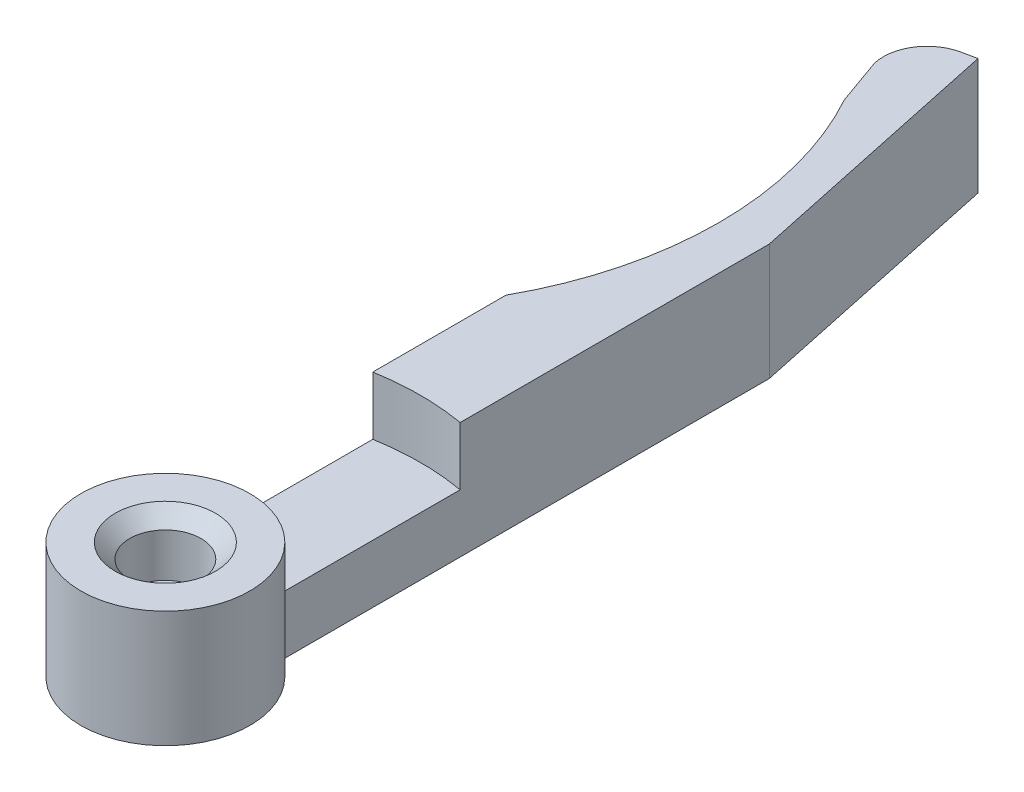
ISO-10303-21;
HEADER;
FILE_DESCRIPTION(('STEP AP214'),'2;1');
FILE_NAME('part.step','',(''),(''),'','','');
FILE_SCHEMA(('AUTOMOTIVE_DESIGN { 1 0 10303 214 1 1 1 1 }'));
ENDSEC;
DATA;
#1=APPLICATION_CONTEXT('core data for automotive mechanical design processes');
#2=APPLICATION_PROTOCOL_DEFINITION('international standard','automotive_design',2000,#1);
#3=PRODUCT_CONTEXT('',#1,'mechanical');
#4=PRODUCT('Part','Part','',(#3));
#5=PRODUCT_RELATED_PRODUCT_CATEGORY('part','',(#4));
#6=PRODUCT_DEFINITION_FORMATION('','',#4);
#7=PRODUCT_DEFINITION_CONTEXT('part definition',#1,'design');
#8=PRODUCT_DEFINITION('design','',#6,#7);
#9=PRODUCT_DEFINITION_SHAPE('','',#8);
#10=(LENGTH_UNIT() NAMED_UNIT(*) SI_UNIT(.MILLI.,.METRE.));
#11=(NAMED_UNIT(*) PLANE_ANGLE_UNIT() SI_UNIT($,.RADIAN.));
#12=(NAMED_UNIT(*) SI_UNIT($,.STERADIAN.) SOLID_ANGLE_UNIT());
#13=UNCERTAINTY_MEASURE_WITH_UNIT(LENGTH_MEASURE(1.E-05),#10,'distance_accuracy_value','');
#14=(GEOMETRIC_REPRESENTATION_CONTEXT(3) GLOBAL_UNCERTAINTY_ASSIGNED_CONTEXT((#13)) GLOBAL_UNIT_ASSIGNED_CONTEXT((#10,
#11,#12)) REPRESENTATION_CONTEXT('',''));
#15=CARTESIAN_POINT('',(0.,0.,0.));
#16=DIRECTION('',(0.,0.,1.));
#17=DIRECTION('',(1.,0.,0.));
#18=AXIS2_PLACEMENT_3D('',#15,#16,#17);
#19=CARTESIAN_POINT('',(0.,8.,0.));
#20=DIRECTION('',(0.,1.,0.));
#21=DIRECTION('',(0.,0.,1.));
#22=AXIS2_PLACEMENT_3D('',#19,#20,#21);
#23=PLANE('',#22);
#24=CARTESIAN_POINT('',(0.,8.,0.));
#25=DIRECTION('',(0.,1.,0.));
#26=DIRECTION('',(0.,0.,1.));
#27=AXIS2_PLACEMENT_3D('',#24,#25,#26);
#28=CIRCLE('',#27,3.45000000000001);
#29=CARTESIAN_POINT('',(0.,8.,3.45000000000003));
#30=VERTEX_POINT('',#29);
#31=EDGE_CURVE('E11',#30,#30,#28,.F.);
#32=ORIENTED_EDGE('',*,*,#31,.T.);
#33=EDGE_LOOP('',(#32));
#34=FACE_BOUND('',#33,.T.);
#35=CARTESIAN_POINT('',(0.,8.,0.));
#36=DIRECTION('',(0.,1.,0.));
#37=DIRECTION('',(0.,0.,1.));
#38=AXIS2_PLACEMENT_3D('',#35,#36,#37);
#39=CIRCLE('',#38,5.8);
#40=CARTESIAN_POINT('',(0.,8.,5.8));
#41=VERTEX_POINT('',#40);
#42=EDGE_CURVE('E168',#41,#41,#39,.T.);
#43=ORIENTED_EDGE('',*,*,#42,.T.);
#44=EDGE_LOOP('',(#43));
#45=FACE_BOUND('',#44,.T.);
#46=ADVANCED_FACE('F45',(#34,#45),#23,.T.);
#47=CARTESIAN_POINT('',(0.,-0.00100000000000013,0.));
#48=DIRECTION('',(0.,1.,0.));
#49=DIRECTION('',(0.,0.,1.));
#50=AXIS2_PLACEMENT_3D('',#47,#48,#49);
#51=CYLINDRICAL_SURFACE('',#50,1.75);
#52=CARTESIAN_POINT('',(0.,4.,0.));
#53=DIRECTION('',(0.,1.,0.));
#54=DIRECTION('',(0.,0.,1.));
#55=AXIS2_PLACEMENT_3D('',#52,#53,#54);
#56=CIRCLE('',#55,1.75);
#57=CARTESIAN_POINT('',(0.,4.,1.75000000000002));
#58=VERTEX_POINT('',#57);
#59=EDGE_CURVE('E185',#58,#58,#56,.T.);
#60=ORIENTED_EDGE('',*,*,#59,.T.);
#61=EDGE_LOOP('',(#60));
#62=FACE_BOUND('',#61,.T.);
#63=CARTESIAN_POINT('',(0.,2.5,0.));
#64=DIRECTION('',(0.,-1.,0.));
#65=DIRECTION('',(0.,0.,-1.));
#66=AXIS2_PLACEMENT_3D('',#63,#64,#65);
#67=CIRCLE('',#66,1.75);
#68=CARTESIAN_POINT('',(0.,2.5,-1.74999999999998));
#69=VERTEX_POINT('',#68);
#70=EDGE_CURVE('E183',#69,#69,#67,.F.);
#71=ORIENTED_EDGE('',*,*,#70,.F.);
#72=EDGE_LOOP('',(#71));
#73=FACE_BOUND('',#72,.T.);
#74=ADVANCED_FACE('F205',(#62,#73),#51,.F.);
#75=CARTESIAN_POINT('',(0.,8.,0.));
#76=DIRECTION('',(0.,-1.,0.));
#77=DIRECTION('',(0.,0.,-1.));
#78=AXIS2_PLACEMENT_3D('',#75,#76,#77);
#79=CYLINDRICAL_SURFACE('',#78,5.8);
#80=DIRECTION('',(0.,-1.,0.));
#81=VECTOR('',#80,1.);
#82=CARTESIAN_POINT('',(2.99999999999999,8.,-4.96386945839635));
#83=LINE('',#82,#81);
#84=CARTESIAN_POINT('',(2.99999999999999,4.,-4.96386945839635));
#85=VERTEX_POINT('',#84);
#86=CARTESIAN_POINT('',(2.99999999999999,0.,-4.96386945839635));
#87=VERTEX_POINT('',#86);
#88=EDGE_CURVE('E181',#85,#87,#83,.T.);
#89=ORIENTED_EDGE('',*,*,#88,.F.);
#90=CARTESIAN_POINT('',(0.,4.,0.));
#91=DIRECTION('',(0.,-1.,0.));
#92=DIRECTION('',(0.,0.,-1.));
#93=AXIS2_PLACEMENT_3D('',#90,#91,#92);
#94=CIRCLE('',#93,5.80000000000002);
#95=CARTESIAN_POINT('',(-2.99999999999999,4.,-4.96386945839635));
#96=VERTEX_POINT('',#95);
#97=EDGE_CURVE('E284',#96,#85,#94,.T.);
#98=ORIENTED_EDGE('',*,*,#97,.F.);
#99=DIRECTION('',(0.,-1.,0.));
#100=VECTOR('',#99,1.);
#101=CARTESIAN_POINT('',(-2.99999999999999,8.,-4.96386945839635));
#102=LINE('',#101,#100);
#103=CARTESIAN_POINT('',(-2.99999999999999,0.,-4.96386945839635));
#104=VERTEX_POINT('',#103);
#105=EDGE_CURVE('E104',#96,#104,#102,.T.);
#106=ORIENTED_EDGE('',*,*,#105,.T.);
#107=CARTESIAN_POINT('',(0.,0.,0.));
#108=DIRECTION('',(0.,1.,0.));
#109=DIRECTION('',(0.,0.,1.));
#110=AXIS2_PLACEMENT_3D('',#107,#108,#109);
#111=CIRCLE('',#110,5.8);
#112=EDGE_CURVE('E152',#104,#87,#111,.T.);
#113=ORIENTED_EDGE('',*,*,#112,.T.);
#114=EDGE_LOOP('',(#89,#98,#106,#113));
#115=FACE_BOUND('',#114,.T.);
#116=ORIENTED_EDGE('',*,*,#42,.F.);
#117=EDGE_LOOP('',(#116));
#118=FACE_BOUND('',#117,.T.);
#119=ADVANCED_FACE('F211',(#115,#118),#79,.T.);
#120=CARTESIAN_POINT('',(3.,8.,-38.4638694583963));
#121=DIRECTION('',(-1.,0.,0.));
#122=DIRECTION('',(0.,0.,1.));
#123=AXIS2_PLACEMENT_3D('',#120,#121,#122);
#124=PLANE('',#123);
#125=DIRECTION('',(0.,0.,-1.));
#126=VECTOR('',#125,1.);
#127=CARTESIAN_POINT('',(3.,8.,-38.4638694583963));
#128=LINE('',#127,#126);
#129=CARTESIAN_POINT('',(3.,8.,-17.2409396495667));
#130=VERTEX_POINT('',#129);
#131=CARTESIAN_POINT('',(3.,8.,-38.4638694583963));
#132=VERTEX_POINT('',#131);
#133=EDGE_CURVE('E111',#130,#132,#128,.T.);
#134=ORIENTED_EDGE('',*,*,#133,.F.);
#135=DIRECTION('',(0.,1.,0.));
#136=VECTOR('',#135,1.);
#137=CARTESIAN_POINT('',(2.99999999999999,4.,-17.2409396495667));
#138=LINE('',#137,#136);
#139=CARTESIAN_POINT('',(2.99999999999999,4.,-17.2409396495667));
#140=VERTEX_POINT('',#139);
#141=EDGE_CURVE('E61',#140,#130,#138,.T.);
#142=ORIENTED_EDGE('',*,*,#141,.F.);
#143=DIRECTION('',(0.,0.,-1.));
#144=VECTOR('',#143,1.);
#145=CARTESIAN_POINT('',(2.99999999999999,4.,-4.96386945839635));
#146=LINE('',#145,#144);
#147=EDGE_CURVE('E289',#85,#140,#146,.T.);
#148=ORIENTED_EDGE('',*,*,#147,.F.);
#149=ORIENTED_EDGE('',*,*,#88,.T.);
#150=DIRECTION('',(0.,0.,-1.));
#151=VECTOR('',#150,1.);
#152=CARTESIAN_POINT('',(3.,0.,-38.4638694583963));
#153=LINE('',#152,#151);
#154=CARTESIAN_POINT('',(3.,0.,-38.4638694583963));
#155=VERTEX_POINT('',#154);
#156=EDGE_CURVE('E154',#87,#155,#153,.T.);
#157=ORIENTED_EDGE('',*,*,#156,.T.);
#158=DIRECTION('',(0.,-1.,0.));
#159=VECTOR('',#158,1.);
#160=CARTESIAN_POINT('',(3.,8.,-38.4638694583963));
#161=LINE('',#160,#159);
#162=EDGE_CURVE('E178',#132,#155,#161,.T.);
#163=ORIENTED_EDGE('',*,*,#162,.F.);
#164=EDGE_LOOP('',(#134,#142,#148,#149,#157,#163));
#165=FACE_BOUND('',#164,.T.);
#166=ADVANCED_FACE('F248',(#165),#124,.F.);
#167=CARTESIAN_POINT('',(-0.867157449210331,8.,-56.6574148320451));
#168=DIRECTION('',(-0.978147600733806,0.,0.20791169081776));
#169=DIRECTION('',(0.20791169081776,0.,0.978147600733806));
#170=AXIS2_PLACEMENT_3D('',#167,#168,#169);
#171=PLANE('',#170);
#172=DIRECTION('',(-0.20791169081776,0.,-0.978147600733805));
#173=VECTOR('',#172,1.);
#174=CARTESIAN_POINT('',(-0.867157449210331,0.,-56.6574148320451));
#175=LINE('',#174,#173);
#176=CARTESIAN_POINT('',(-0.867157449210331,0.,-56.6574148320451));
#177=VERTEX_POINT('',#176);
#178=EDGE_CURVE('E157',#155,#177,#175,.T.);
#179=ORIENTED_EDGE('',*,*,#178,.T.);
#180=DIRECTION('',(0.,-1.,0.));
#181=VECTOR('',#180,1.);
#182=CARTESIAN_POINT('',(-0.867157449210331,8.,-56.6574148320451));
#183=LINE('',#182,#181);
#184=CARTESIAN_POINT('',(-0.867157449210331,8.,-56.6574148320451));
#185=VERTEX_POINT('',#184);
#186=EDGE_CURVE('E175',#185,#177,#183,.T.);
#187=ORIENTED_EDGE('',*,*,#186,.F.);
#188=DIRECTION('',(-0.20791169081776,0.,-0.978147600733805));
#189=VECTOR('',#188,1.);
#190=CARTESIAN_POINT('',(-0.867157449210331,8.,-56.6574148320451));
#191=LINE('',#190,#189);
#192=EDGE_CURVE('E261',#132,#185,#191,.T.);
#193=ORIENTED_EDGE('',*,*,#192,.F.);
#194=ORIENTED_EDGE('',*,*,#162,.T.);
#195=EDGE_LOOP('',(#179,#187,#193,#194));
#196=FACE_BOUND('',#195,.T.);
#197=ADVANCED_FACE('F244',(#196),#171,.F.);
#198=CARTESIAN_POINT('',(-1.84530504994414,8.,-56.4495031412274));
#199=DIRECTION('',(0.207911690817762,0.,0.978147600733805));
#200=DIRECTION('',(0.978147600733805,0.,-0.207911690817762));
#201=AXIS2_PLACEMENT_3D('',#198,#199,#200);
#202=PLANE('',#201);
#203=DIRECTION('',(-0.978147600733805,0.,0.207911690817762));
#204=VECTOR('',#203,1.);
#205=CARTESIAN_POINT('',(-1.84530504994414,0.,-56.4495031412274));
#206=LINE('',#205,#204);
#207=CARTESIAN_POINT('',(-1.84530504994414,0.,-56.4495031412274));
#208=VERTEX_POINT('',#207);
#209=EDGE_CURVE('E159',#177,#208,#206,.T.);
#210=ORIENTED_EDGE('',*,*,#209,.T.);
#211=DIRECTION('',(0.,-1.,0.));
#212=VECTOR('',#211,1.);
#213=CARTESIAN_POINT('',(-1.84530504994414,8.,-56.4495031412274));
#214=LINE('',#213,#212);
#215=CARTESIAN_POINT('',(-1.84530504994414,8.,-56.4495031412274));
#216=VERTEX_POINT('',#215);
#217=EDGE_CURVE('E141',#216,#208,#214,.T.);
#218=ORIENTED_EDGE('',*,*,#217,.F.);
#219=DIRECTION('',(-0.978147600733805,0.,0.207911690817762));
#220=VECTOR('',#219,1.);
#221=CARTESIAN_POINT('',(-1.84530504994414,8.,-56.4495031412274));
#222=LINE('',#221,#220);
#223=EDGE_CURVE('E129',#185,#216,#222,.T.);
#224=ORIENTED_EDGE('',*,*,#223,.F.);
#225=ORIENTED_EDGE('',*,*,#186,.T.);
#226=EDGE_LOOP('',(#210,#218,#224,#225));
#227=FACE_BOUND('',#226,.T.);
#228=ADVANCED_FACE('F241',(#227),#202,.F.);
#229=CARTESIAN_POINT('',(-1.22156997749086,8.,-53.515060339026));
#230=DIRECTION('',(0.,-1.,0.));
#231=DIRECTION('',(0.,0.,-1.));
#232=AXIS2_PLACEMENT_3D('',#229,#230,#231);
#233=CYLINDRICAL_SURFACE('',#232,3.);
#234=CARTESIAN_POINT('',(-1.22156997749086,0.,-53.515060339026));
#235=DIRECTION('',(0.,1.,0.));
#236=DIRECTION('',(0.,0.,-1.));
#237=AXIS2_PLACEMENT_3D('',#234,#235,#236);
#238=CIRCLE('',#237,3.);
#239=CARTESIAN_POINT('',(-4.14041417555798,0.,-52.8219885192194));
#240=VERTEX_POINT('',#239);
#241=EDGE_CURVE('E138',#208,#240,#238,.T.);
#242=ORIENTED_EDGE('',*,*,#241,.T.);
#243=DIRECTION('',(0.,-1.,0.));
#244=VECTOR('',#243,1.);
#245=CARTESIAN_POINT('',(-4.14041417555798,8.,-52.8219885192194));
#246=LINE('',#245,#244);
#247=CARTESIAN_POINT('',(-4.14041417555798,8.,-52.8219885192194));
#248=VERTEX_POINT('',#247);
#249=EDGE_CURVE('E135',#248,#240,#246,.T.);
#250=ORIENTED_EDGE('',*,*,#249,.F.);
#251=CARTESIAN_POINT('',(-1.22156997749086,8.,-53.515060339026));
#252=DIRECTION('',(0.,1.,0.));
#253=DIRECTION('',(0.,0.,-1.));
#254=AXIS2_PLACEMENT_3D('',#251,#252,#253);
#255=CIRCLE('',#254,3.);
#256=EDGE_CURVE('E122',#216,#248,#255,.T.);
#257=ORIENTED_EDGE('',*,*,#256,.F.);
#258=ORIENTED_EDGE('',*,*,#217,.T.);
#259=EDGE_LOOP('',(#242,#250,#257,#258));
#260=FACE_BOUND('',#259,.T.);
#261=ADVANCED_FACE('F136',(#260),#233,.T.);
#262=CARTESIAN_POINT('',(-4.14041417555798,8.,-52.8219885192194));
#263=DIRECTION('',(0.942070141352118,0.,-0.33541593398764));
#264=DIRECTION('',(-0.33541593398764,0.,-0.942070141352118));
#265=AXIS2_PLACEMENT_3D('',#262,#263,#264);
#266=PLANE('',#265);
#267=DIRECTION('',(0.33541593398764,0.,0.942070141352118));
#268=VECTOR('',#267,1.);
#269=CARTESIAN_POINT('',(-4.14041417555798,0.,-52.8219885192194));
#270=LINE('',#269,#268);
#271=CARTESIAN_POINT('',(-3.,0.,-49.6189500386222));
#272=VERTEX_POINT('',#271);
#273=EDGE_CURVE('E162',#240,#272,#270,.T.);
#274=ORIENTED_EDGE('',*,*,#273,.T.);
#275=DIRECTION('',(0.,-1.,0.));
#276=VECTOR('',#275,1.);
#277=CARTESIAN_POINT('',(-3.,8.,-49.6189500386222));
#278=LINE('',#277,#276);
#279=CARTESIAN_POINT('',(-3.,8.,-49.6189500386222));
#280=VERTEX_POINT('',#279);
#281=EDGE_CURVE('E142',#280,#272,#278,.T.);
#282=ORIENTED_EDGE('',*,*,#281,.F.);
#283=DIRECTION('',(0.33541593398764,0.,0.942070141352118));
#284=VECTOR('',#283,1.);
#285=CARTESIAN_POINT('',(-4.14041417555798,8.,-52.8219885192194));
#286=LINE('',#285,#284);
#287=EDGE_CURVE('E126',#248,#280,#286,.T.);
#288=ORIENTED_EDGE('',*,*,#287,.F.);
#289=ORIENTED_EDGE('',*,*,#249,.T.);
#290=EDGE_LOOP('',(#274,#282,#288,#289));
#291=FACE_BOUND('',#290,.T.);
#292=ADVANCED_FACE('F144',(#291),#266,.F.);
#293=CARTESIAN_POINT('',(-24.,8.,-38.));
#294=DIRECTION('',(0.,-1.,0.));
#295=DIRECTION('',(0.,0.,-1.));
#296=AXIS2_PLACEMENT_3D('',#293,#294,#295);
#297=CYLINDRICAL_SURFACE('',#296,24.);
#298=CARTESIAN_POINT('',(-24.,0.,-38.));
#299=DIRECTION('',(0.,-1.,0.));
#300=DIRECTION('',(0.,0.,-1.));
#301=AXIS2_PLACEMENT_3D('',#298,#299,#300);
#302=CIRCLE('',#301,24.);
#303=CARTESIAN_POINT('',(-2.99999999999999,0.,-26.3810499613777));
#304=VERTEX_POINT('',#303);
#305=EDGE_CURVE('E164',#272,#304,#302,.T.);
#306=ORIENTED_EDGE('',*,*,#305,.T.);
#307=DIRECTION('',(0.,-1.,0.));
#308=VECTOR('',#307,1.);
#309=CARTESIAN_POINT('',(-2.99999999999999,8.,-26.3810499613777));
#310=LINE('',#309,#308);
#311=CARTESIAN_POINT('',(-2.99999999999999,8.,-26.3810499613777));
#312=VERTEX_POINT('',#311);
#313=EDGE_CURVE('E170',#312,#304,#310,.T.);
#314=ORIENTED_EDGE('',*,*,#313,.F.);
#315=CARTESIAN_POINT('',(-24.,8.,-38.));
#316=DIRECTION('',(0.,-1.,0.));
#317=DIRECTION('',(0.,0.,-1.));
#318=AXIS2_PLACEMENT_3D('',#315,#316,#317);
#319=CIRCLE('',#318,24.);
#320=EDGE_CURVE('E70',#280,#312,#319,.T.);
#321=ORIENTED_EDGE('',*,*,#320,.F.);
#322=ORIENTED_EDGE('',*,*,#281,.T.);
#323=EDGE_LOOP('',(#306,#314,#321,#322));
#324=FACE_BOUND('',#323,.T.);
#325=ADVANCED_FACE('F226',(#324),#297,.F.);
#326=CARTESIAN_POINT('',(-2.99999999999999,8.,-26.3810499613777));
#327=DIRECTION('',(1.,0.,0.));
#328=DIRECTION('',(0.,0.,-1.));
#329=AXIS2_PLACEMENT_3D('',#326,#327,#328);
#330=PLANE('',#329);
#331=DIRECTION('',(0.,0.,1.));
#332=VECTOR('',#331,1.);
#333=CARTESIAN_POINT('',(-2.99999999999999,4.,-4.96386945839635));
#334=LINE('',#333,#332);
#335=CARTESIAN_POINT('',(-2.99999999999999,4.,-17.2409396495666));
#336=VERTEX_POINT('',#335);
#337=EDGE_CURVE('E292',#336,#96,#334,.T.);
#338=ORIENTED_EDGE('',*,*,#337,.F.);
#339=DIRECTION('',(0.,1.,0.));
#340=VECTOR('',#339,1.);
#341=CARTESIAN_POINT('',(-2.99999999999999,4.,-17.2409396495666));
#342=LINE('',#341,#340);
#343=CARTESIAN_POINT('',(-2.99999999999999,8.,-17.2409396495666));
#344=VERTEX_POINT('',#343);
#345=EDGE_CURVE('E277',#336,#344,#342,.T.);
#346=ORIENTED_EDGE('',*,*,#345,.T.);
#347=DIRECTION('',(0.,0.,1.));
#348=VECTOR('',#347,1.);
#349=CARTESIAN_POINT('',(-2.99999999999999,8.,-26.3810499613777));
#350=LINE('',#349,#348);
#351=EDGE_CURVE('E147',#312,#344,#350,.T.);
#352=ORIENTED_EDGE('',*,*,#351,.F.);
#353=ORIENTED_EDGE('',*,*,#313,.T.);
#354=DIRECTION('',(0.,0.,1.));
#355=VECTOR('',#354,1.);
#356=CARTESIAN_POINT('',(-2.99999999999999,0.,-26.3810499613777));
#357=LINE('',#356,#355);
#358=EDGE_CURVE('E166',#304,#104,#357,.T.);
#359=ORIENTED_EDGE('',*,*,#358,.T.);
#360=ORIENTED_EDGE('',*,*,#105,.F.);
#361=EDGE_LOOP('',(#338,#346,#352,#353,#359,#360));
#362=FACE_BOUND('',#361,.T.);
#363=ADVANCED_FACE('F219',(#362),#330,.F.);
#364=CARTESIAN_POINT('',(0.,8.,0.));
#365=DIRECTION('',(0.,1.,0.));
#366=DIRECTION('',(0.,0.,-1.));
#367=AXIS2_PLACEMENT_3D('',#364,#365,#366);
#368=CIRCLE('',#367,17.5);
#369=EDGE_CURVE('E278',#130,#344,#368,.T.);
#370=ORIENTED_EDGE('',*,*,#369,.F.);
#371=ORIENTED_EDGE('',*,*,#133,.T.);
#372=ORIENTED_EDGE('',*,*,#192,.T.);
#373=ORIENTED_EDGE('',*,*,#223,.T.);
#374=ORIENTED_EDGE('',*,*,#256,.T.);
#375=ORIENTED_EDGE('',*,*,#287,.T.);
#376=ORIENTED_EDGE('',*,*,#320,.T.);
#377=ORIENTED_EDGE('',*,*,#351,.T.);
#378=EDGE_LOOP('',(#370,#371,#372,#373,#374,#375,#376,#377));
#379=FACE_BOUND('',#378,.T.);
#380=ADVANCED_FACE('F124',(#379),#23,.T.);
#381=CARTESIAN_POINT('',(0.,0.,0.));
#382=DIRECTION('',(0.,1.,0.));
#383=DIRECTION('',(0.,0.,1.));
#384=AXIS2_PLACEMENT_3D('',#381,#382,#383);
#385=PLANE('',#384);
#386=CARTESIAN_POINT('',(0.,0.,0.));
#387=DIRECTION('',(0.,-1.,0.));
#388=DIRECTION('',(0.,0.,-1.));
#389=AXIS2_PLACEMENT_3D('',#386,#387,#388);
#390=CIRCLE('',#389,3.75);
#391=CARTESIAN_POINT('',(0.,0.,-3.74999999999998));
#392=VERTEX_POINT('',#391);
#393=EDGE_CURVE('E301',#392,#392,#390,.T.);
#394=ORIENTED_EDGE('',*,*,#393,.F.);
#395=EDGE_LOOP('',(#394));
#396=FACE_BOUND('',#395,.T.);
#397=ORIENTED_EDGE('',*,*,#112,.F.);
#398=ORIENTED_EDGE('',*,*,#358,.F.);
#399=ORIENTED_EDGE('',*,*,#305,.F.);
#400=ORIENTED_EDGE('',*,*,#273,.F.);
#401=ORIENTED_EDGE('',*,*,#241,.F.);
#402=ORIENTED_EDGE('',*,*,#209,.F.);
#403=ORIENTED_EDGE('',*,*,#178,.F.);
#404=ORIENTED_EDGE('',*,*,#156,.F.);
#405=EDGE_LOOP('',(#397,#398,#399,#400,#401,#402,#403,#404));
#406=FACE_BOUND('',#405,.T.);
#407=ADVANCED_FACE('F218',(#396,#406),#385,.F.);
#408=CARTESIAN_POINT('',(0.,4.,0.));
#409=DIRECTION('',(0.,1.,0.));
#410=DIRECTION('',(0.,0.,1.));
#411=AXIS2_PLACEMENT_3D('',#408,#409,#410);
#412=CYLINDRICAL_SURFACE('',#411,2.45);
#413=CARTESIAN_POINT('',(0.,7.,0.));
#414=DIRECTION('',(0.,1.,0.));
#415=DIRECTION('',(0.,0.,1.));
#416=AXIS2_PLACEMENT_3D('',#413,#414,#415);
#417=CIRCLE('',#416,2.45);
#418=CARTESIAN_POINT('',(0.,7.,2.45000000000002));
#419=VERTEX_POINT('',#418);
#420=EDGE_CURVE('E54',#419,#419,#417,.T.);
#421=ORIENTED_EDGE('',*,*,#420,.T.);
#422=EDGE_LOOP('',(#421));
#423=FACE_BOUND('',#422,.T.);
#424=CARTESIAN_POINT('',(0.,4.,0.));
#425=DIRECTION('',(0.,1.,0.));
#426=DIRECTION('',(0.,0.,1.));
#427=AXIS2_PLACEMENT_3D('',#424,#425,#426);
#428=CIRCLE('',#427,2.45);
#429=CARTESIAN_POINT('',(0.,4.,2.45000000000002));
#430=VERTEX_POINT('',#429);
#431=EDGE_CURVE('E155',#430,#430,#428,.T.);
#432=ORIENTED_EDGE('',*,*,#431,.F.);
#433=EDGE_LOOP('',(#432));
#434=FACE_BOUND('',#433,.T.);
#435=ADVANCED_FACE('F190',(#423,#434),#412,.F.);
#436=CARTESIAN_POINT('',(0.,4.,0.));
#437=DIRECTION('',(0.,1.,0.));
#438=DIRECTION('',(0.,0.,1.));
#439=AXIS2_PLACEMENT_3D('',#436,#437,#438);
#440=PLANE('',#439);
#441=ORIENTED_EDGE('',*,*,#59,.F.);
#442=EDGE_LOOP('',(#441));
#443=FACE_BOUND('',#442,.T.);
#444=ORIENTED_EDGE('',*,*,#431,.T.);
#445=EDGE_LOOP('',(#444));
#446=FACE_BOUND('',#445,.T.);
#447=ADVANCED_FACE('F311',(#443,#446),#440,.T.);
#448=CARTESIAN_POINT('',(0.,2.5,0.));
#449=DIRECTION('',(0.,-1.,0.));
#450=DIRECTION('',(0.,0.,-1.));
#451=AXIS2_PLACEMENT_3D('',#448,#449,#450);
#452=PLANE('',#451);
#453=CARTESIAN_POINT('',(0.,2.5,0.));
#454=DIRECTION('',(0.,-1.,0.));
#455=DIRECTION('',(0.,0.,-1.));
#456=AXIS2_PLACEMENT_3D('',#453,#454,#455);
#457=CIRCLE('',#456,3.75);
#458=CARTESIAN_POINT('',(0.,2.5,-3.74999999999998));
#459=VERTEX_POINT('',#458);
#460=EDGE_CURVE('E186',#459,#459,#457,.T.);
#461=ORIENTED_EDGE('',*,*,#460,.T.);
#462=EDGE_LOOP('',(#461));
#463=FACE_BOUND('',#462,.T.);
#464=ORIENTED_EDGE('',*,*,#70,.T.);
#465=EDGE_LOOP('',(#464));
#466=FACE_BOUND('',#465,.T.);
#467=ADVANCED_FACE('F315',(#463,#466),#452,.T.);
#468=CARTESIAN_POINT('',(0.,2.5,0.));
#469=DIRECTION('',(0.,-1.,0.));
#470=DIRECTION('',(0.,0.,-1.));
#471=AXIS2_PLACEMENT_3D('',#468,#469,#470);
#472=CYLINDRICAL_SURFACE('',#471,3.75);
#473=ORIENTED_EDGE('',*,*,#460,.F.);
#474=EDGE_LOOP('',(#473));
#475=FACE_BOUND('',#474,.T.);
#476=ORIENTED_EDGE('',*,*,#393,.T.);
#477=EDGE_LOOP('',(#476));
#478=FACE_BOUND('',#477,.T.);
#479=ADVANCED_FACE('F319',(#475,#478),#472,.F.);
#480=CARTESIAN_POINT('',(0.,4.,0.));
#481=DIRECTION('',(0.,1.,0.));
#482=DIRECTION('',(0.,0.,1.));
#483=AXIS2_PLACEMENT_3D('',#480,#481,#482);
#484=CYLINDRICAL_SURFACE('',#483,17.5);
#485=ORIENTED_EDGE('',*,*,#369,.T.);
#486=ORIENTED_EDGE('',*,*,#345,.F.);
#487=CARTESIAN_POINT('',(0.,4.,0.));
#488=DIRECTION('',(0.,1.,0.));
#489=DIRECTION('',(0.,0.,-1.));
#490=AXIS2_PLACEMENT_3D('',#487,#488,#489);
#491=CIRCLE('',#490,17.5);
#492=EDGE_CURVE('E293',#140,#336,#491,.T.);
#493=ORIENTED_EDGE('',*,*,#492,.F.);
#494=ORIENTED_EDGE('',*,*,#141,.T.);
#495=EDGE_LOOP('',(#485,#486,#493,#494));
#496=FACE_BOUND('',#495,.T.);
#497=ADVANCED_FACE('F200',(#496),#484,.F.);
#498=CARTESIAN_POINT('',(0.,4.,0.));
#499=DIRECTION('',(0.,-1.,0.));
#500=DIRECTION('',(0.,0.,-1.));
#501=AXIS2_PLACEMENT_3D('',#498,#499,#500);
#502=PLANE('',#501);
#503=ORIENTED_EDGE('',*,*,#97,.T.);
#504=ORIENTED_EDGE('',*,*,#147,.T.);
#505=ORIENTED_EDGE('',*,*,#492,.T.);
#506=ORIENTED_EDGE('',*,*,#337,.T.);
#507=EDGE_LOOP('',(#503,#504,#505,#506));
#508=FACE_BOUND('',#507,.T.);
#509=ADVANCED_FACE('F194',(#508),#502,.F.);
#510=CARTESIAN_POINT('',(0.,7.,0.));
#511=DIRECTION('',(0.,1.,0.));
#512=DIRECTION('',(0.,0.,1.));
#513=AXIS2_PLACEMENT_3D('',#510,#511,#512);
#514=CONICAL_SURFACE('',#513,2.45,0.785398163397451);
#515=ORIENTED_EDGE('',*,*,#31,.F.);
#516=EDGE_LOOP('',(#515));
#517=FACE_BOUND('',#516,.T.);
#518=ORIENTED_EDGE('',*,*,#420,.F.);
#519=EDGE_LOOP('',(#518));
#520=FACE_BOUND('',#519,.T.);
#521=ADVANCED_FACE('F48',(#517,#520),#514,.F.);
#522=CLOSED_SHELL('',(#46,#74,#119,#166,#197,#228,#261,#292,#325,#363,#380,#407,#435,#447,#467,
#479,#497,#509,#521));
#523=MANIFOLD_SOLID_BREP('B2',#522);
#524=ADVANCED_BREP_SHAPE_REPRESENTATION('',(#18,#523),#14);
#525=SHAPE_DEFINITION_REPRESENTATION(#9,#524);
ENDSEC;
END-ISO-10303-21;
